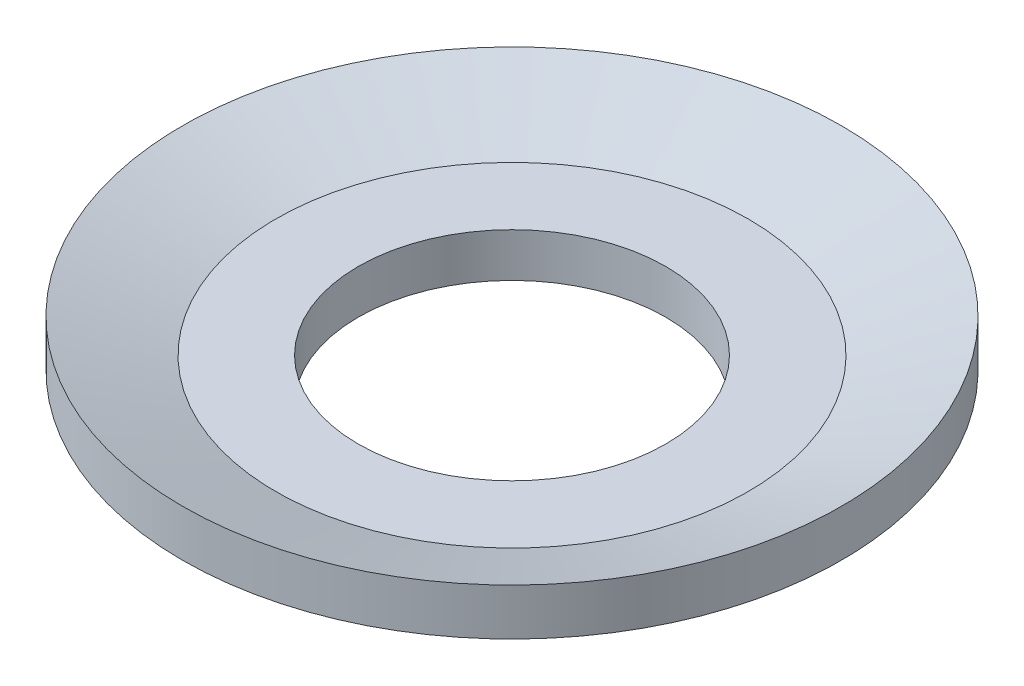
ISO-10303-21;
HEADER;
FILE_DESCRIPTION(('STEP AP214'),'2;1');
FILE_NAME('part.step','',(''),(''),'','','');
FILE_SCHEMA(('AUTOMOTIVE_DESIGN { 1 0 10303 214 1 1 1 1 }'));
ENDSEC;
DATA;
#1=APPLICATION_CONTEXT('core data for automotive mechanical design processes');
#2=APPLICATION_PROTOCOL_DEFINITION('international standard','automotive_design',2000,#1);
#3=PRODUCT_CONTEXT('',#1,'mechanical');
#4=PRODUCT('Part','Part','',(#3));
#5=PRODUCT_RELATED_PRODUCT_CATEGORY('part','',(#4));
#6=PRODUCT_DEFINITION_FORMATION('','',#4);
#7=PRODUCT_DEFINITION_CONTEXT('part definition',#1,'design');
#8=PRODUCT_DEFINITION('design','',#6,#7);
#9=PRODUCT_DEFINITION_SHAPE('','',#8);
#10=(LENGTH_UNIT() NAMED_UNIT(*) SI_UNIT(.MILLI.,.METRE.));
#11=(NAMED_UNIT(*) PLANE_ANGLE_UNIT() SI_UNIT($,.RADIAN.));
#12=(NAMED_UNIT(*) SI_UNIT($,.STERADIAN.) SOLID_ANGLE_UNIT());
#13=UNCERTAINTY_MEASURE_WITH_UNIT(LENGTH_MEASURE(1.E-05),#10,'distance_accuracy_value','');
#14=(GEOMETRIC_REPRESENTATION_CONTEXT(3) GLOBAL_UNCERTAINTY_ASSIGNED_CONTEXT((#13)) GLOBAL_UNIT_ASSIGNED_CONTEXT((#10,
#11,#12)) REPRESENTATION_CONTEXT('',''));
#15=CARTESIAN_POINT('',(0.,0.,0.));
#16=DIRECTION('',(0.,0.,1.));
#17=DIRECTION('',(1.,0.,0.));
#18=AXIS2_PLACEMENT_3D('',#15,#16,#17);
#19=CARTESIAN_POINT('',(0.,0.,0.));
#20=DIRECTION('',(0.,-1.,0.));
#21=DIRECTION('',(0.,0.,-1.));
#22=AXIS2_PLACEMENT_3D('',#19,#20,#21);
#23=CYLINDRICAL_SURFACE('',#22,1.4);
#24=CARTESIAN_POINT('',(0.,0.,0.));
#25=DIRECTION('',(0.,-1.,0.));
#26=DIRECTION('',(0.,0.,-1.));
#27=AXIS2_PLACEMENT_3D('',#24,#25,#26);
#28=CIRCLE('',#27,1.4);
#29=CARTESIAN_POINT('',(0.,0.,-1.4));
#30=VERTEX_POINT('',#29);
#31=EDGE_CURVE('E54',#30,#30,#28,.T.);
#32=ORIENTED_EDGE('',*,*,#31,.T.);
#33=EDGE_LOOP('',(#32));
#34=FACE_BOUND('',#33,.T.);
#35=CARTESIAN_POINT('',(0.,0.399999999999999,0.));
#36=DIRECTION('',(0.,-1.,0.));
#37=DIRECTION('',(0.,0.,-1.));
#38=AXIS2_PLACEMENT_3D('',#35,#36,#37);
#39=CIRCLE('',#38,1.4);
#40=CARTESIAN_POINT('',(0.,0.399999999999999,-1.4));
#41=VERTEX_POINT('',#40);
#42=EDGE_CURVE('E10',#41,#41,#39,.T.);
#43=ORIENTED_EDGE('',*,*,#42,.F.);
#44=EDGE_LOOP('',(#43));
#45=FACE_BOUND('',#44,.T.);
#46=ADVANCED_FACE('F29',(#34,#45),#23,.F.);
#47=CARTESIAN_POINT('',(1.4,0.399999999999999,0.));
#48=DIRECTION('',(0.,1.,0.));
#49=DIRECTION('',(0.,0.,1.));
#50=AXIS2_PLACEMENT_3D('',#47,#48,#49);
#51=PLANE('',#50);
#52=ORIENTED_EDGE('',*,*,#42,.T.);
#53=EDGE_LOOP('',(#52));
#54=FACE_BOUND('',#53,.T.);
#55=CARTESIAN_POINT('',(0.,0.399999999999999,0.));
#56=DIRECTION('',(0.,-1.,0.));
#57=DIRECTION('',(0.,0.,-1.));
#58=AXIS2_PLACEMENT_3D('',#55,#56,#57);
#59=CIRCLE('',#58,2.15);
#60=CARTESIAN_POINT('',(0.,0.399999999999999,-2.15));
#61=VERTEX_POINT('',#60);
#62=EDGE_CURVE('E35',#61,#61,#59,.T.);
#63=ORIENTED_EDGE('',*,*,#62,.F.);
#64=EDGE_LOOP('',(#63));
#65=FACE_BOUND('',#64,.T.);
#66=ADVANCED_FACE('F72',(#54,#65),#51,.T.);
#67=CARTESIAN_POINT('',(0.,0.709374699126266,0.));
#68=DIRECTION('',(0.,1.,0.));
#69=DIRECTION('',(0.,0.,1.));
#70=AXIS2_PLACEMENT_3D('',#67,#68,#69);
#71=CONICAL_SURFACE('',#70,3.,1.22173047639604);
#72=ORIENTED_EDGE('',*,*,#62,.T.);
#73=EDGE_LOOP('',(#72));
#74=FACE_BOUND('',#73,.T.);
#75=CARTESIAN_POINT('',(0.,0.709374699126266,0.));
#76=DIRECTION('',(0.,-1.,0.));
#77=DIRECTION('',(0.,0.,-1.));
#78=AXIS2_PLACEMENT_3D('',#75,#76,#77);
#79=CIRCLE('',#78,3.);
#80=CARTESIAN_POINT('',(0.,0.709374699126266,-3.));
#81=VERTEX_POINT('',#80);
#82=EDGE_CURVE('E39',#81,#81,#79,.T.);
#83=ORIENTED_EDGE('',*,*,#82,.F.);
#84=EDGE_LOOP('',(#83));
#85=FACE_BOUND('',#84,.T.);
#86=ADVANCED_FACE('F76',(#74,#85),#71,.F.);
#87=CARTESIAN_POINT('',(0.,0.,0.));
#88=DIRECTION('',(0.,-1.,0.));
#89=DIRECTION('',(0.,0.,-1.));
#90=AXIS2_PLACEMENT_3D('',#87,#88,#89);
#91=CYLINDRICAL_SURFACE('',#90,3.);
#92=ORIENTED_EDGE('',*,*,#82,.T.);
#93=EDGE_LOOP('',(#92));
#94=FACE_BOUND('',#93,.T.);
#95=CARTESIAN_POINT('',(0.,0.283703590135902,0.));
#96=DIRECTION('',(0.,-1.,0.));
#97=DIRECTION('',(0.,0.,-1.));
#98=AXIS2_PLACEMENT_3D('',#95,#96,#97);
#99=CIRCLE('',#98,3.);
#100=CARTESIAN_POINT('',(0.,0.283703590135902,-3.));
#101=VERTEX_POINT('',#100);
#102=EDGE_CURVE('E43',#101,#101,#99,.T.);
#103=ORIENTED_EDGE('',*,*,#102,.F.);
#104=EDGE_LOOP('',(#103));
#105=FACE_BOUND('',#104,.T.);
#106=ADVANCED_FACE('F80',(#94,#105),#91,.T.);
#107=CARTESIAN_POINT('',(0.,0.0241229516856362,0.));
#108=DIRECTION('',(0.,1.,0.));
#109=DIRECTION('',(0.,0.,1.));
#110=AXIS2_PLACEMENT_3D('',#107,#108,#109);
#111=CONICAL_SURFACE('',#110,2.28680805733027,1.22173047639604);
#112=ORIENTED_EDGE('',*,*,#102,.T.);
#113=EDGE_LOOP('',(#112));
#114=FACE_BOUND('',#113,.T.);
#115=CARTESIAN_POINT('',(0.,0.0241229516856362,0.));
#116=DIRECTION('',(0.,-1.,0.));
#117=DIRECTION('',(0.,0.,-1.));
#118=AXIS2_PLACEMENT_3D('',#115,#116,#117);
#119=CIRCLE('',#118,2.28680805733027);
#120=CARTESIAN_POINT('',(0.,0.0241229516856362,-2.28680805733027));
#121=VERTEX_POINT('',#120);
#122=EDGE_CURVE('E48',#121,#121,#119,.T.);
#123=ORIENTED_EDGE('',*,*,#122,.F.);
#124=EDGE_LOOP('',(#123));
#125=FACE_BOUND('',#124,.T.);
#126=ADVANCED_FACE('F68',(#114,#125),#111,.T.);
#127=CARTESIAN_POINT('',(0.,0.399999999999999,0.));
#128=DIRECTION('',(0.,-1.,0.));
#129=DIRECTION('',(0.,0.,-1.));
#130=AXIS2_PLACEMENT_3D('',#127,#128,#129);
#131=TOROIDAL_SURFACE('',#130,2.15,0.4);
#132=ORIENTED_EDGE('',*,*,#122,.T.);
#133=EDGE_LOOP('',(#132));
#134=FACE_BOUND('',#133,.T.);
#135=CARTESIAN_POINT('',(0.,0.,0.));
#136=DIRECTION('',(0.,-1.,0.));
#137=DIRECTION('',(0.,0.,-1.));
#138=AXIS2_PLACEMENT_3D('',#135,#136,#137);
#139=CIRCLE('',#138,2.15);
#140=CARTESIAN_POINT('',(0.,0.,-2.15));
#141=VERTEX_POINT('',#140);
#142=EDGE_CURVE('E51',#141,#141,#139,.T.);
#143=ORIENTED_EDGE('',*,*,#142,.F.);
#144=EDGE_LOOP('',(#143));
#145=FACE_BOUND('',#144,.T.);
#146=ADVANCED_FACE('F62',(#134,#145),#131,.T.);
#147=CARTESIAN_POINT('',(1.4,0.,0.));
#148=DIRECTION('',(0.,-1.,0.));
#149=DIRECTION('',(0.,0.,-1.));
#150=AXIS2_PLACEMENT_3D('',#147,#148,#149);
#151=PLANE('',#150);
#152=ORIENTED_EDGE('',*,*,#142,.T.);
#153=EDGE_LOOP('',(#152));
#154=FACE_BOUND('',#153,.T.);
#155=ORIENTED_EDGE('',*,*,#31,.F.);
#156=EDGE_LOOP('',(#155));
#157=FACE_BOUND('',#156,.T.);
#158=ADVANCED_FACE('F60',(#154,#157),#151,.T.);
#159=CLOSED_SHELL('',(#46,#66,#86,#106,#126,#146,#158));
#160=MANIFOLD_SOLID_BREP('B2',#159);
#161=ADVANCED_BREP_SHAPE_REPRESENTATION('',(#18,#160),#14);
#162=SHAPE_DEFINITION_REPRESENTATION(#9,#161);
ENDSEC;
END-ISO-10303-21;
